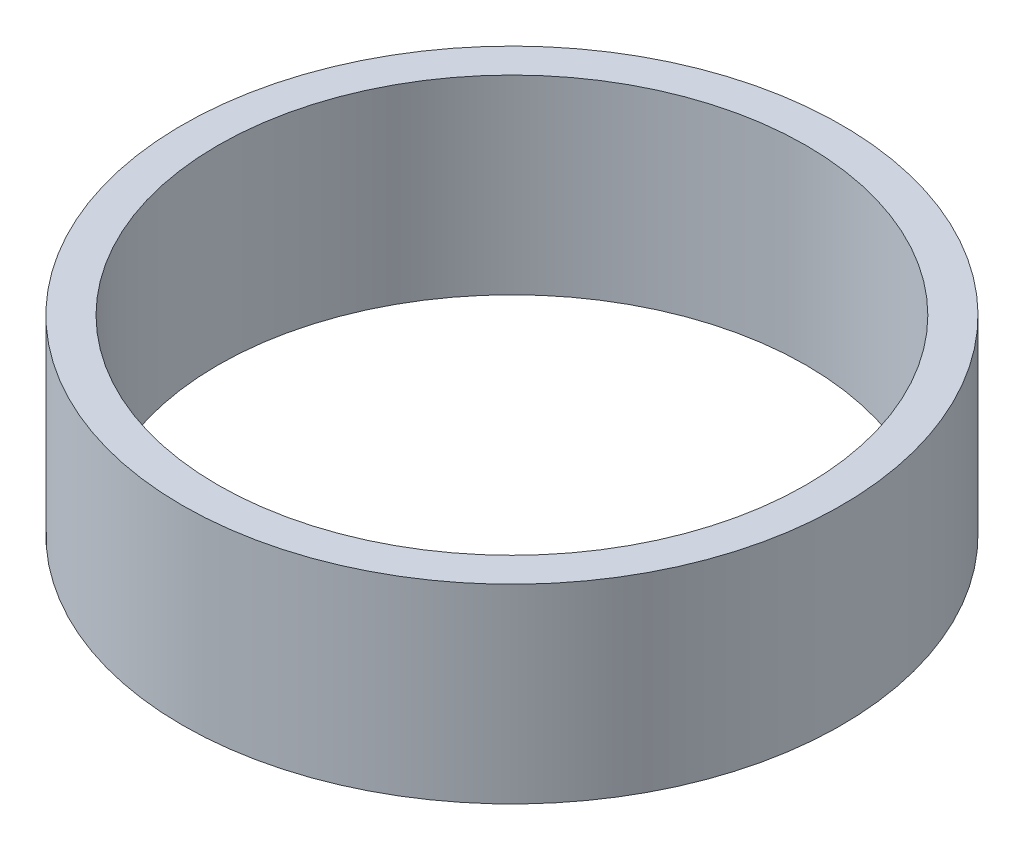
ISO-10303-21;
HEADER;
FILE_DESCRIPTION(('STEP AP214'),'2;1');
FILE_NAME('part.step','',(''),(''),'','','');
FILE_SCHEMA(('AUTOMOTIVE_DESIGN { 1 0 10303 214 1 1 1 1 }'));
ENDSEC;
DATA;
#1=APPLICATION_CONTEXT('core data for automotive mechanical design processes');
#2=APPLICATION_PROTOCOL_DEFINITION('international standard','automotive_design',2000,#1);
#3=PRODUCT_CONTEXT('',#1,'mechanical');
#4=PRODUCT('Part','Part','',(#3));
#5=PRODUCT_RELATED_PRODUCT_CATEGORY('part','',(#4));
#6=PRODUCT_DEFINITION_FORMATION('','',#4);
#7=PRODUCT_DEFINITION_CONTEXT('part definition',#1,'design');
#8=PRODUCT_DEFINITION('design','',#6,#7);
#9=PRODUCT_DEFINITION_SHAPE('','',#8);
#10=(LENGTH_UNIT() NAMED_UNIT(*) SI_UNIT(.MILLI.,.METRE.));
#11=(NAMED_UNIT(*) PLANE_ANGLE_UNIT() SI_UNIT($,.RADIAN.));
#12=(NAMED_UNIT(*) SI_UNIT($,.STERADIAN.) SOLID_ANGLE_UNIT());
#13=UNCERTAINTY_MEASURE_WITH_UNIT(LENGTH_MEASURE(1.E-05),#10,'distance_accuracy_value','');
#14=(GEOMETRIC_REPRESENTATION_CONTEXT(3) GLOBAL_UNCERTAINTY_ASSIGNED_CONTEXT((#13)) GLOBAL_UNIT_ASSIGNED_CONTEXT((#10,
#11,#12)) REPRESENTATION_CONTEXT('',''));
#15=CARTESIAN_POINT('',(0.,0.,0.));
#16=DIRECTION('',(0.,0.,1.));
#17=DIRECTION('',(1.,0.,0.));
#18=AXIS2_PLACEMENT_3D('',#15,#16,#17);
#19=CARTESIAN_POINT('',(0.,11.,0.));
#20=DIRECTION('',(0.,1.,0.));
#21=DIRECTION('',(0.,0.,1.));
#22=AXIS2_PLACEMENT_3D('',#19,#20,#21);
#23=PLANE('',#22);
#24=CARTESIAN_POINT('',(0.,11.,0.));
#25=DIRECTION('',(0.,1.,0.));
#26=DIRECTION('',(0.,0.,1.));
#27=AXIS2_PLACEMENT_3D('',#24,#25,#26);
#28=CIRCLE('',#27,19.05);
#29=CARTESIAN_POINT('',(0.,11.,19.05));
#30=VERTEX_POINT('',#29);
#31=EDGE_CURVE('E10',#30,#30,#28,.T.);
#32=ORIENTED_EDGE('',*,*,#31,.T.);
#33=EDGE_LOOP('',(#32));
#34=FACE_BOUND('',#33,.T.);
#35=CARTESIAN_POINT('',(0.,11.,0.));
#36=DIRECTION('',(0.,1.,0.));
#37=DIRECTION('',(0.,0.,1.));
#38=AXIS2_PLACEMENT_3D('',#35,#36,#37);
#39=CIRCLE('',#38,17.);
#40=CARTESIAN_POINT('',(0.,11.,17.));
#41=VERTEX_POINT('',#40);
#42=EDGE_CURVE('E46',#41,#41,#39,.T.);
#43=ORIENTED_EDGE('',*,*,#42,.F.);
#44=EDGE_LOOP('',(#43));
#45=FACE_BOUND('',#44,.T.);
#46=ADVANCED_FACE('F35',(#34,#45),#23,.T.);
#47=CARTESIAN_POINT('',(0.,0.,0.));
#48=DIRECTION('',(0.,1.,0.));
#49=DIRECTION('',(0.,0.,1.));
#50=AXIS2_PLACEMENT_3D('',#47,#48,#49);
#51=PLANE('',#50);
#52=CARTESIAN_POINT('',(0.,0.,0.));
#53=DIRECTION('',(0.,1.,0.));
#54=DIRECTION('',(0.,0.,1.));
#55=AXIS2_PLACEMENT_3D('',#52,#53,#54);
#56=CIRCLE('',#55,19.05);
#57=CARTESIAN_POINT('',(0.,0.,19.05));
#58=VERTEX_POINT('',#57);
#59=EDGE_CURVE('E39',#58,#58,#56,.T.);
#60=ORIENTED_EDGE('',*,*,#59,.F.);
#61=EDGE_LOOP('',(#60));
#62=FACE_BOUND('',#61,.T.);
#63=CARTESIAN_POINT('',(0.,0.,0.));
#64=DIRECTION('',(0.,1.,0.));
#65=DIRECTION('',(0.,0.,1.));
#66=AXIS2_PLACEMENT_3D('',#63,#64,#65);
#67=CIRCLE('',#66,17.);
#68=CARTESIAN_POINT('',(0.,0.,17.));
#69=VERTEX_POINT('',#68);
#70=EDGE_CURVE('E48',#69,#69,#67,.T.);
#71=ORIENTED_EDGE('',*,*,#70,.T.);
#72=EDGE_LOOP('',(#71));
#73=FACE_BOUND('',#72,.T.);
#74=ADVANCED_FACE('F58',(#62,#73),#51,.F.);
#75=CARTESIAN_POINT('',(0.,11.,0.));
#76=DIRECTION('',(0.,-1.,0.));
#77=DIRECTION('',(0.,0.,-1.));
#78=AXIS2_PLACEMENT_3D('',#75,#76,#77);
#79=CYLINDRICAL_SURFACE('',#78,19.05);
#80=ORIENTED_EDGE('',*,*,#31,.F.);
#81=EDGE_LOOP('',(#80));
#82=FACE_BOUND('',#81,.T.);
#83=ORIENTED_EDGE('',*,*,#59,.T.);
#84=EDGE_LOOP('',(#83));
#85=FACE_BOUND('',#84,.T.);
#86=ADVANCED_FACE('F37',(#82,#85),#79,.T.);
#87=CARTESIAN_POINT('',(0.,11.,0.));
#88=DIRECTION('',(0.,-1.,0.));
#89=DIRECTION('',(0.,0.,-1.));
#90=AXIS2_PLACEMENT_3D('',#87,#88,#89);
#91=CYLINDRICAL_SURFACE('',#90,17.);
#92=ORIENTED_EDGE('',*,*,#42,.T.);
#93=EDGE_LOOP('',(#92));
#94=FACE_BOUND('',#93,.T.);
#95=ORIENTED_EDGE('',*,*,#70,.F.);
#96=EDGE_LOOP('',(#95));
#97=FACE_BOUND('',#96,.T.);
#98=ADVANCED_FACE('F54',(#94,#97),#91,.F.);
#99=CLOSED_SHELL('',(#46,#74,#86,#98));
#100=MANIFOLD_SOLID_BREP('B2',#99);
#101=ADVANCED_BREP_SHAPE_REPRESENTATION('',(#18,#100),#14);
#102=SHAPE_DEFINITION_REPRESENTATION(#9,#101);
ENDSEC;
END-ISO-10303-21;
